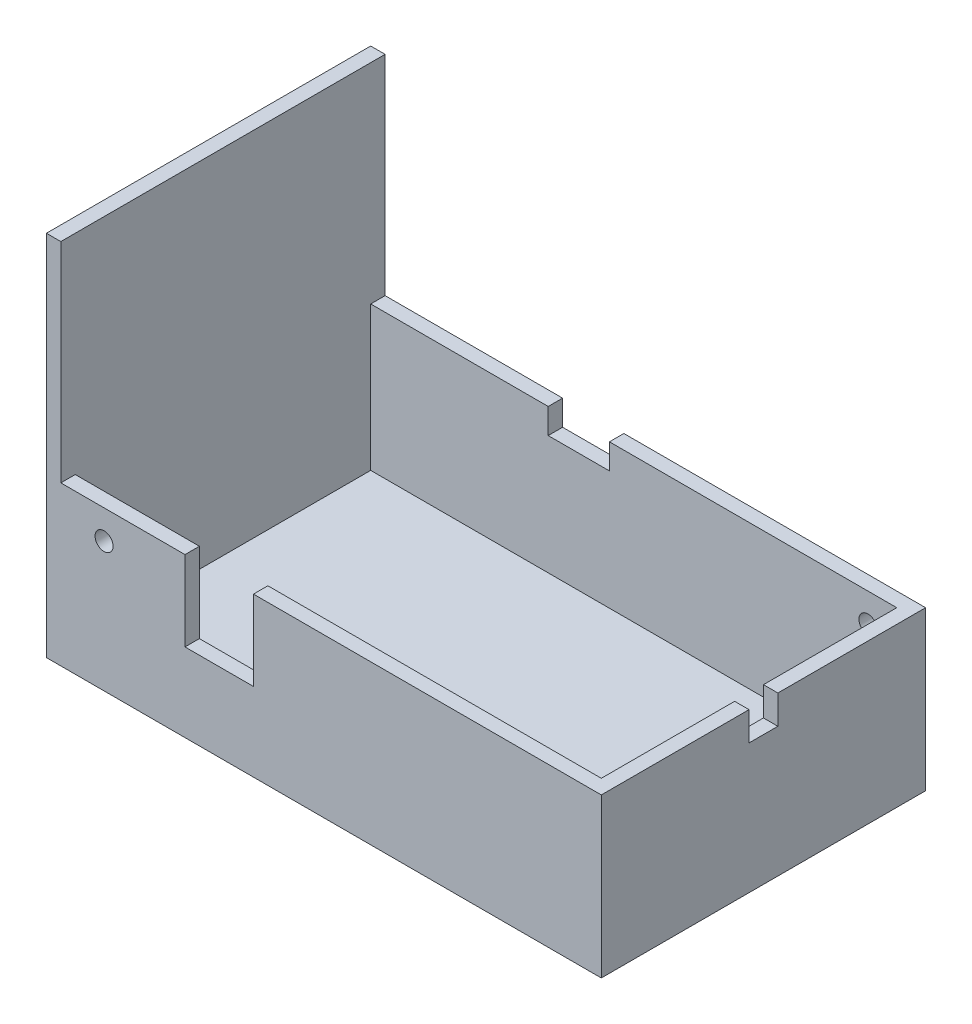
ISO-10303-21;
HEADER;
FILE_DESCRIPTION(('STEP AP214'),'2;1');
FILE_NAME('part.step','',(''),(''),'','','');
FILE_SCHEMA(('AUTOMOTIVE_DESIGN { 1 0 10303 214 1 1 1 1 }'));
ENDSEC;
DATA;
#1=APPLICATION_CONTEXT('core data for automotive mechanical design processes');
#2=APPLICATION_PROTOCOL_DEFINITION('international standard','automotive_design',2000,#1);
#3=PRODUCT_CONTEXT('',#1,'mechanical');
#4=PRODUCT('Part','Part','',(#3));
#5=PRODUCT_RELATED_PRODUCT_CATEGORY('part','',(#4));
#6=PRODUCT_DEFINITION_FORMATION('','',#4);
#7=PRODUCT_DEFINITION_CONTEXT('part definition',#1,'design');
#8=PRODUCT_DEFINITION('design','',#6,#7);
#9=PRODUCT_DEFINITION_SHAPE('','',#8);
#10=(LENGTH_UNIT() NAMED_UNIT(*) SI_UNIT(.MILLI.,.METRE.));
#11=(NAMED_UNIT(*) PLANE_ANGLE_UNIT() SI_UNIT($,.RADIAN.));
#12=(NAMED_UNIT(*) SI_UNIT($,.STERADIAN.) SOLID_ANGLE_UNIT());
#13=UNCERTAINTY_MEASURE_WITH_UNIT(LENGTH_MEASURE(1.E-05),#10,'distance_accuracy_value','');
#14=(GEOMETRIC_REPRESENTATION_CONTEXT(3) GLOBAL_UNCERTAINTY_ASSIGNED_CONTEXT((#13)) GLOBAL_UNIT_ASSIGNED_CONTEXT((#10,
#11,#12)) REPRESENTATION_CONTEXT('',''));
#15=CARTESIAN_POINT('',(0.,0.,0.));
#16=DIRECTION('',(0.,0.,1.));
#17=DIRECTION('',(1.,0.,0.));
#18=AXIS2_PLACEMENT_3D('',#15,#16,#17);
#19=CARTESIAN_POINT('',(0.,22.,0.));
#20=DIRECTION('',(0.,-1.,0.));
#21=DIRECTION('',(0.,0.,-1.));
#22=AXIS2_PLACEMENT_3D('',#19,#20,#21);
#23=PLANE('',#22);
#24=DIRECTION('',(0.,0.,-1.));
#25=VECTOR('',#24,1.);
#26=CARTESIAN_POINT('',(36.5,22.,-20.5));
#27=LINE('',#26,#25);
#28=CARTESIAN_POINT('',(36.5,22.,-2.));
#29=VERTEX_POINT('',#28);
#30=CARTESIAN_POINT('',(36.5,22.,-20.5));
#31=VERTEX_POINT('',#30);
#32=EDGE_CURVE('E301',#29,#31,#27,.T.);
#33=ORIENTED_EDGE('',*,*,#32,.F.);
#34=DIRECTION('',(1.,0.,0.));
#35=VECTOR('',#34,1.);
#36=CARTESIAN_POINT('',(30.8431457505076,22.,-2.));
#37=LINE('',#36,#35);
#38=CARTESIAN_POINT('',(38.5,22.,-2.));
#39=VERTEX_POINT('',#38);
#40=EDGE_CURVE('E190',#29,#39,#37,.T.);
#41=ORIENTED_EDGE('',*,*,#40,.T.);
#42=DIRECTION('',(0.,0.,-1.));
#43=VECTOR('',#42,1.);
#44=CARTESIAN_POINT('',(38.5,22.,-22.5));
#45=LINE('',#44,#43);
#46=CARTESIAN_POINT('',(38.5,22.,-22.5));
#47=VERTEX_POINT('',#46);
#48=EDGE_CURVE('E333',#39,#47,#45,.T.);
#49=ORIENTED_EDGE('',*,*,#48,.T.);
#50=DIRECTION('',(-1.,0.,0.));
#51=VECTOR('',#50,1.);
#52=CARTESIAN_POINT('',(-38.5,22.,-22.5));
#53=LINE('',#52,#51);
#54=CARTESIAN_POINT('',(-3.37,22.,-22.5));
#55=VERTEX_POINT('',#54);
#56=EDGE_CURVE('E338',#47,#55,#53,.T.);
#57=ORIENTED_EDGE('',*,*,#56,.T.);
#58=DIRECTION('',(0.,0.,-1.));
#59=VECTOR('',#58,1.);
#60=CARTESIAN_POINT('',(-3.37,22.,-11.3076118445749));
#61=LINE('',#60,#59);
#62=CARTESIAN_POINT('',(-3.37,22.,-20.5));
#63=VERTEX_POINT('',#62);
#64=EDGE_CURVE('E222',#63,#55,#61,.T.);
#65=ORIENTED_EDGE('',*,*,#64,.F.);
#66=DIRECTION('',(-1.,0.,0.));
#67=VECTOR('',#66,1.);
#68=CARTESIAN_POINT('',(-36.5,22.,-20.5));
#69=LINE('',#68,#67);
#70=EDGE_CURVE('E306',#31,#63,#69,.T.);
#71=ORIENTED_EDGE('',*,*,#70,.F.);
#72=EDGE_LOOP('',(#33,#41,#49,#57,#65,#71));
#73=FACE_BOUND('',#72,.T.);
#74=ADVANCED_FACE('F34',(#73),#23,.F.);
#75=DIRECTION('',(0.,0.,-1.));
#76=VECTOR('',#75,1.);
#77=CARTESIAN_POINT('',(-11.87,22.,-11.3076118445749));
#78=LINE('',#77,#76);
#79=CARTESIAN_POINT('',(-11.87,22.,-20.5));
#80=VERTEX_POINT('',#79);
#81=CARTESIAN_POINT('',(-11.87,22.,-22.5));
#82=VERTEX_POINT('',#81);
#83=EDGE_CURVE('E223',#80,#82,#78,.T.);
#84=ORIENTED_EDGE('',*,*,#83,.T.);
#85=CARTESIAN_POINT('',(-36.5,22.,-22.5));
#86=VERTEX_POINT('',#85);
#87=EDGE_CURVE('E337',#82,#86,#53,.T.);
#88=ORIENTED_EDGE('',*,*,#87,.T.);
#89=DIRECTION('',(0.,0.,-1.));
#90=VECTOR('',#89,1.);
#91=CARTESIAN_POINT('',(-36.5,22.,22.5));
#92=LINE('',#91,#90);
#93=CARTESIAN_POINT('',(-36.5,22.,-20.5));
#94=VERTEX_POINT('',#93);
#95=EDGE_CURVE('E11',#94,#86,#92,.T.);
#96=ORIENTED_EDGE('',*,*,#95,.F.);
#97=EDGE_CURVE('E305',#80,#94,#69,.T.);
#98=ORIENTED_EDGE('',*,*,#97,.F.);
#99=EDGE_LOOP('',(#84,#88,#96,#98));
#100=FACE_BOUND('',#99,.T.);
#101=ADVANCED_FACE('F394',(#100),#23,.F.);
#102=CARTESIAN_POINT('',(-38.5,2.,-22.5));
#103=DIRECTION('',(0.,0.,1.));
#104=DIRECTION('',(1.,0.,0.));
#105=AXIS2_PLACEMENT_3D('',#102,#103,#104);
#106=PLANE('',#105);
#107=CARTESIAN_POINT('',(32.5,18.,-22.5));
#108=DIRECTION('',(0.,0.,-1.));
#109=DIRECTION('',(-1.,0.,0.));
#110=AXIS2_PLACEMENT_3D('',#107,#108,#109);
#111=CIRCLE('',#110,1.25);
#112=CARTESIAN_POINT('',(31.25,18.,-22.5));
#113=VERTEX_POINT('',#112);
#114=EDGE_CURVE('E274',#113,#113,#111,.T.);
#115=ORIENTED_EDGE('',*,*,#114,.F.);
#116=EDGE_LOOP('',(#115));
#117=FACE_BOUND('',#116,.T.);
#118=DIRECTION('',(0.,-1.,0.));
#119=VECTOR('',#118,1.);
#120=CARTESIAN_POINT('',(-11.87,22.,-22.5));
#121=LINE('',#120,#119);
#122=CARTESIAN_POINT('',(-11.87,18.5,-22.5));
#123=VERTEX_POINT('',#122);
#124=EDGE_CURVE('E219',#82,#123,#121,.T.);
#125=ORIENTED_EDGE('',*,*,#124,.T.);
#126=DIRECTION('',(-1.,0.,0.));
#127=VECTOR('',#126,1.);
#128=CARTESIAN_POINT('',(-3.37000000000001,18.5,-22.5));
#129=LINE('',#128,#127);
#130=CARTESIAN_POINT('',(-3.37000000000001,18.5,-22.5));
#131=VERTEX_POINT('',#130);
#132=EDGE_CURVE('E224',#131,#123,#129,.T.);
#133=ORIENTED_EDGE('',*,*,#132,.F.);
#134=DIRECTION('',(0.,-1.,0.));
#135=VECTOR('',#134,1.);
#136=CARTESIAN_POINT('',(-3.37,22.,-22.5));
#137=LINE('',#136,#135);
#138=EDGE_CURVE('E228',#55,#131,#137,.T.);
#139=ORIENTED_EDGE('',*,*,#138,.F.);
#140=ORIENTED_EDGE('',*,*,#56,.F.);
#141=DIRECTION('',(0.,-1.,0.));
#142=VECTOR('',#141,1.);
#143=CARTESIAN_POINT('',(38.5,2.,-22.5));
#144=LINE('',#143,#142);
#145=CARTESIAN_POINT('',(38.5,0.,-22.5));
#146=VERTEX_POINT('',#145);
#147=EDGE_CURVE('E38',#47,#146,#144,.T.);
#148=ORIENTED_EDGE('',*,*,#147,.T.);
#149=DIRECTION('',(-1.,0.,0.));
#150=VECTOR('',#149,1.);
#151=CARTESIAN_POINT('',(-38.5,0.,-22.5));
#152=LINE('',#151,#150);
#153=CARTESIAN_POINT('',(-38.5,0.,-22.5));
#154=VERTEX_POINT('',#153);
#155=EDGE_CURVE('E344',#146,#154,#152,.T.);
#156=ORIENTED_EDGE('',*,*,#155,.T.);
#157=DIRECTION('',(0.,-1.,0.));
#158=VECTOR('',#157,1.);
#159=CARTESIAN_POINT('',(-38.5,2.,-22.5));
#160=LINE('',#159,#158);
#161=CARTESIAN_POINT('',(-38.5,51.,-22.5));
#162=VERTEX_POINT('',#161);
#163=EDGE_CURVE('E355',#162,#154,#160,.T.);
#164=ORIENTED_EDGE('',*,*,#163,.F.);
#165=DIRECTION('',(-1.,0.,0.));
#166=VECTOR('',#165,1.);
#167=CARTESIAN_POINT('',(-38.5,51.,-22.5));
#168=LINE('',#167,#166);
#169=CARTESIAN_POINT('',(-36.5,51.,-22.5));
#170=VERTEX_POINT('',#169);
#171=EDGE_CURVE('E287',#170,#162,#168,.T.);
#172=ORIENTED_EDGE('',*,*,#171,.F.);
#173=DIRECTION('',(0.,-1.,0.));
#174=VECTOR('',#173,1.);
#175=CARTESIAN_POINT('',(-36.5,51.,-22.5));
#176=LINE('',#175,#174);
#177=EDGE_CURVE('E289',#170,#86,#176,.T.);
#178=ORIENTED_EDGE('',*,*,#177,.T.);
#179=ORIENTED_EDGE('',*,*,#87,.F.);
#180=EDGE_LOOP('',(#125,#133,#139,#140,#148,#156,#164,#172,#178,#179));
#181=FACE_BOUND('',#180,.T.);
#182=ADVANCED_FACE('F364',(#117,#181),#106,.F.);
#183=CARTESIAN_POINT('',(-36.5,22.,-20.5));
#184=DIRECTION('',(0.,0.,1.));
#185=DIRECTION('',(1.,0.,0.));
#186=AXIS2_PLACEMENT_3D('',#183,#184,#185);
#187=PLANE('',#186);
#188=CARTESIAN_POINT('',(32.5,18.,-20.5));
#189=DIRECTION('',(0.,0.,1.));
#190=DIRECTION('',(1.,0.,0.));
#191=AXIS2_PLACEMENT_3D('',#188,#189,#190);
#192=CIRCLE('',#191,1.25);
#193=CARTESIAN_POINT('',(33.75,18.,-20.5));
#194=VERTEX_POINT('',#193);
#195=EDGE_CURVE('E277',#194,#194,#192,.F.);
#196=ORIENTED_EDGE('',*,*,#195,.T.);
#197=EDGE_LOOP('',(#196));
#198=FACE_BOUND('',#197,.T.);
#199=DIRECTION('',(-1.,0.,0.));
#200=VECTOR('',#199,1.);
#201=CARTESIAN_POINT('',(-3.37000000000001,18.5,-20.5));
#202=LINE('',#201,#200);
#203=CARTESIAN_POINT('',(-3.37000000000001,18.5,-20.5));
#204=VERTEX_POINT('',#203);
#205=CARTESIAN_POINT('',(-11.87,18.5,-20.5));
#206=VERTEX_POINT('',#205);
#207=EDGE_CURVE('E227',#204,#206,#202,.T.);
#208=ORIENTED_EDGE('',*,*,#207,.T.);
#209=DIRECTION('',(0.,-1.,0.));
#210=VECTOR('',#209,1.);
#211=CARTESIAN_POINT('',(-11.87,22.,-20.5));
#212=LINE('',#211,#210);
#213=EDGE_CURVE('E218',#80,#206,#212,.T.);
#214=ORIENTED_EDGE('',*,*,#213,.F.);
#215=ORIENTED_EDGE('',*,*,#97,.T.);
#216=DIRECTION('',(0.,-1.,0.));
#217=VECTOR('',#216,1.);
#218=CARTESIAN_POINT('',(-36.5,22.,-20.5));
#219=LINE('',#218,#217);
#220=CARTESIAN_POINT('',(-36.5,2.,-20.5));
#221=VERTEX_POINT('',#220);
#222=EDGE_CURVE('E309',#94,#221,#219,.T.);
#223=ORIENTED_EDGE('',*,*,#222,.T.);
#224=DIRECTION('',(-1.,0.,0.));
#225=VECTOR('',#224,1.);
#226=CARTESIAN_POINT('',(-36.5,2.,-20.5));
#227=LINE('',#226,#225);
#228=CARTESIAN_POINT('',(36.5,2.,-20.5));
#229=VERTEX_POINT('',#228);
#230=EDGE_CURVE('E318',#229,#221,#227,.T.);
#231=ORIENTED_EDGE('',*,*,#230,.F.);
#232=DIRECTION('',(0.,-1.,0.));
#233=VECTOR('',#232,1.);
#234=CARTESIAN_POINT('',(36.5,22.,-20.5));
#235=LINE('',#234,#233);
#236=EDGE_CURVE('E322',#31,#229,#235,.T.);
#237=ORIENTED_EDGE('',*,*,#236,.F.);
#238=ORIENTED_EDGE('',*,*,#70,.T.);
#239=DIRECTION('',(0.,-1.,0.));
#240=VECTOR('',#239,1.);
#241=CARTESIAN_POINT('',(-3.37,22.,-20.5));
#242=LINE('',#241,#240);
#243=EDGE_CURVE('E233',#63,#204,#242,.T.);
#244=ORIENTED_EDGE('',*,*,#243,.T.);
#245=EDGE_LOOP('',(#208,#214,#215,#223,#231,#237,#238,#244));
#246=FACE_BOUND('',#245,.T.);
#247=ADVANCED_FACE('F400',(#198,#246),#187,.T.);
#248=CARTESIAN_POINT('',(38.5,22.,22.5));
#249=VERTEX_POINT('',#248);
#250=CARTESIAN_POINT('',(38.5,22.,2.));
#251=VERTEX_POINT('',#250);
#252=EDGE_CURVE('E334',#249,#251,#45,.T.);
#253=ORIENTED_EDGE('',*,*,#252,.T.);
#254=DIRECTION('',(1.,0.,0.));
#255=VECTOR('',#254,1.);
#256=CARTESIAN_POINT('',(30.8431457505076,22.,2.));
#257=LINE('',#256,#255);
#258=CARTESIAN_POINT('',(36.5,22.,2.));
#259=VERTEX_POINT('',#258);
#260=EDGE_CURVE('E213',#259,#251,#257,.T.);
#261=ORIENTED_EDGE('',*,*,#260,.F.);
#262=CARTESIAN_POINT('',(36.5,22.,20.5));
#263=VERTEX_POINT('',#262);
#264=EDGE_CURVE('E303',#263,#259,#27,.T.);
#265=ORIENTED_EDGE('',*,*,#264,.F.);
#266=DIRECTION('',(1.,0.,0.));
#267=VECTOR('',#266,1.);
#268=CARTESIAN_POINT('',(36.5,22.,20.5));
#269=LINE('',#268,#267);
#270=CARTESIAN_POINT('',(-9.77000000000001,22.,20.5));
#271=VERTEX_POINT('',#270);
#272=EDGE_CURVE('E302',#271,#263,#269,.T.);
#273=ORIENTED_EDGE('',*,*,#272,.F.);
#274=DIRECTION('',(0.,0.,1.));
#275=VECTOR('',#274,1.);
#276=CARTESIAN_POINT('',(-9.77000000000001,22.,5.8897296397363));
#277=LINE('',#276,#275);
#278=CARTESIAN_POINT('',(-9.77000000000001,22.,22.5));
#279=VERTEX_POINT('',#278);
#280=EDGE_CURVE('E262',#271,#279,#277,.T.);
#281=ORIENTED_EDGE('',*,*,#280,.T.);
#282=DIRECTION('',(1.,0.,0.));
#283=VECTOR('',#282,1.);
#284=CARTESIAN_POINT('',(38.5,22.,22.5));
#285=LINE('',#284,#283);
#286=EDGE_CURVE('E329',#279,#249,#285,.T.);
#287=ORIENTED_EDGE('',*,*,#286,.T.);
#288=EDGE_LOOP('',(#253,#261,#265,#273,#281,#287));
#289=FACE_BOUND('',#288,.T.);
#290=ADVANCED_FACE('F412',(#289),#23,.F.);
#291=CARTESIAN_POINT('',(-36.5,22.,22.5));
#292=VERTEX_POINT('',#291);
#293=CARTESIAN_POINT('',(-19.27,22.,22.5));
#294=VERTEX_POINT('',#293);
#295=EDGE_CURVE('E330',#292,#294,#285,.T.);
#296=ORIENTED_EDGE('',*,*,#295,.T.);
#297=DIRECTION('',(0.,0.,1.));
#298=VECTOR('',#297,1.);
#299=CARTESIAN_POINT('',(-19.27,22.,5.8897296397363));
#300=LINE('',#299,#298);
#301=CARTESIAN_POINT('',(-19.27,22.,20.5));
#302=VERTEX_POINT('',#301);
#303=EDGE_CURVE('E258',#302,#294,#300,.T.);
#304=ORIENTED_EDGE('',*,*,#303,.F.);
#305=CARTESIAN_POINT('',(-36.5,22.,20.5));
#306=VERTEX_POINT('',#305);
#307=EDGE_CURVE('E298',#306,#302,#269,.T.);
#308=ORIENTED_EDGE('',*,*,#307,.F.);
#309=EDGE_CURVE('E44',#292,#306,#92,.T.);
#310=ORIENTED_EDGE('',*,*,#309,.F.);
#311=EDGE_LOOP('',(#296,#304,#308,#310));
#312=FACE_BOUND('',#311,.T.);
#313=ADVANCED_FACE('F432',(#312),#23,.F.);
#314=CARTESIAN_POINT('',(38.5,2.,22.5));
#315=DIRECTION('',(-1.,0.,0.));
#316=DIRECTION('',(0.,0.,1.));
#317=AXIS2_PLACEMENT_3D('',#314,#315,#316);
#318=PLANE('',#317);
#319=ORIENTED_EDGE('',*,*,#48,.F.);
#320=DIRECTION('',(0.,1.,0.));
#321=VECTOR('',#320,1.);
#322=CARTESIAN_POINT('',(38.5,22.,-2.));
#323=LINE('',#322,#321);
#324=CARTESIAN_POINT('',(38.5,18.,-2.));
#325=VERTEX_POINT('',#324);
#326=EDGE_CURVE('E206',#325,#39,#323,.T.);
#327=ORIENTED_EDGE('',*,*,#326,.F.);
#328=DIRECTION('',(0.,0.,-1.));
#329=VECTOR('',#328,1.);
#330=CARTESIAN_POINT('',(38.5,18.,2.));
#331=LINE('',#330,#329);
#332=CARTESIAN_POINT('',(38.5,18.,2.));
#333=VERTEX_POINT('',#332);
#334=EDGE_CURVE('E200',#333,#325,#331,.T.);
#335=ORIENTED_EDGE('',*,*,#334,.F.);
#336=DIRECTION('',(0.,-1.,0.));
#337=VECTOR('',#336,1.);
#338=CARTESIAN_POINT('',(38.5,22.,2.));
#339=LINE('',#338,#337);
#340=EDGE_CURVE('E211',#251,#333,#339,.T.);
#341=ORIENTED_EDGE('',*,*,#340,.F.);
#342=ORIENTED_EDGE('',*,*,#252,.F.);
#343=DIRECTION('',(0.,-1.,0.));
#344=VECTOR('',#343,1.);
#345=CARTESIAN_POINT('',(38.5,2.,22.5));
#346=LINE('',#345,#344);
#347=CARTESIAN_POINT('',(38.5,0.,22.5));
#348=VERTEX_POINT('',#347);
#349=EDGE_CURVE('E350',#249,#348,#346,.T.);
#350=ORIENTED_EDGE('',*,*,#349,.T.);
#351=DIRECTION('',(0.,0.,-1.));
#352=VECTOR('',#351,1.);
#353=CARTESIAN_POINT('',(38.5,0.,22.5));
#354=LINE('',#353,#352);
#355=EDGE_CURVE('E341',#348,#146,#354,.T.);
#356=ORIENTED_EDGE('',*,*,#355,.T.);
#357=ORIENTED_EDGE('',*,*,#147,.F.);
#358=EDGE_LOOP('',(#319,#327,#335,#341,#342,#350,#356,#357));
#359=FACE_BOUND('',#358,.T.);
#360=ADVANCED_FACE('F36',(#359),#318,.F.);
#361=CARTESIAN_POINT('',(-38.5,2.,22.5));
#362=DIRECTION('',(1.,0.,0.));
#363=DIRECTION('',(0.,0.,-1.));
#364=AXIS2_PLACEMENT_3D('',#361,#362,#363);
#365=PLANE('',#364);
#366=DIRECTION('',(0.,0.,1.));
#367=VECTOR('',#366,1.);
#368=CARTESIAN_POINT('',(-38.5,0.,22.5));
#369=LINE('',#368,#367);
#370=CARTESIAN_POINT('',(-38.5,0.,22.5));
#371=VERTEX_POINT('',#370);
#372=EDGE_CURVE('E346',#154,#371,#369,.T.);
#373=ORIENTED_EDGE('',*,*,#372,.T.);
#374=DIRECTION('',(0.,-1.,0.));
#375=VECTOR('',#374,1.);
#376=CARTESIAN_POINT('',(-38.5,2.,22.5));
#377=LINE('',#376,#375);
#378=CARTESIAN_POINT('',(-38.5,51.,22.5));
#379=VERTEX_POINT('',#378);
#380=EDGE_CURVE('E353',#379,#371,#377,.T.);
#381=ORIENTED_EDGE('',*,*,#380,.F.);
#382=DIRECTION('',(0.,0.,1.));
#383=VECTOR('',#382,1.);
#384=CARTESIAN_POINT('',(-38.5,51.,22.5));
#385=LINE('',#384,#383);
#386=EDGE_CURVE('E280',#162,#379,#385,.T.);
#387=ORIENTED_EDGE('',*,*,#386,.F.);
#388=ORIENTED_EDGE('',*,*,#163,.T.);
#389=EDGE_LOOP('',(#373,#381,#387,#388));
#390=FACE_BOUND('',#389,.T.);
#391=ADVANCED_FACE('F374',(#390),#365,.F.);
#392=CARTESIAN_POINT('',(-38.5,2.,22.5));
#393=DIRECTION('',(0.,0.,-1.));
#394=DIRECTION('',(-1.,0.,0.));
#395=AXIS2_PLACEMENT_3D('',#392,#393,#394);
#396=PLANE('',#395);
#397=CARTESIAN_POINT('',(-30.5,18.,22.5));
#398=DIRECTION('',(0.,0.,1.));
#399=DIRECTION('',(1.,0.,0.));
#400=AXIS2_PLACEMENT_3D('',#397,#398,#399);
#401=CIRCLE('',#400,1.25);
#402=CARTESIAN_POINT('',(-29.25,18.,22.5));
#403=VERTEX_POINT('',#402);
#404=EDGE_CURVE('E268',#403,#403,#401,.T.);
#405=ORIENTED_EDGE('',*,*,#404,.F.);
#406=EDGE_LOOP('',(#405));
#407=FACE_BOUND('',#406,.T.);
#408=ORIENTED_EDGE('',*,*,#286,.F.);
#409=DIRECTION('',(0.,1.,0.));
#410=VECTOR('',#409,1.);
#411=CARTESIAN_POINT('',(-9.77000000000001,22.,22.5));
#412=LINE('',#411,#410);
#413=CARTESIAN_POINT('',(-9.77,10.9,22.5));
#414=VERTEX_POINT('',#413);
#415=EDGE_CURVE('E243',#414,#279,#412,.T.);
#416=ORIENTED_EDGE('',*,*,#415,.F.);
#417=DIRECTION('',(1.,0.,0.));
#418=VECTOR('',#417,1.);
#419=CARTESIAN_POINT('',(-19.27,10.9,22.5));
#420=LINE('',#419,#418);
#421=CARTESIAN_POINT('',(-19.27,10.9,22.5));
#422=VERTEX_POINT('',#421);
#423=EDGE_CURVE('E246',#422,#414,#420,.T.);
#424=ORIENTED_EDGE('',*,*,#423,.F.);
#425=DIRECTION('',(0.,-1.,0.));
#426=VECTOR('',#425,1.);
#427=CARTESIAN_POINT('',(-19.27,22.,22.5));
#428=LINE('',#427,#426);
#429=EDGE_CURVE('E242',#294,#422,#428,.T.);
#430=ORIENTED_EDGE('',*,*,#429,.F.);
#431=ORIENTED_EDGE('',*,*,#295,.F.);
#432=DIRECTION('',(0.,-1.,0.));
#433=VECTOR('',#432,1.);
#434=CARTESIAN_POINT('',(-36.5,51.,22.5));
#435=LINE('',#434,#433);
#436=CARTESIAN_POINT('',(-36.5,51.,22.5));
#437=VERTEX_POINT('',#436);
#438=EDGE_CURVE('E294',#437,#292,#435,.T.);
#439=ORIENTED_EDGE('',*,*,#438,.F.);
#440=DIRECTION('',(1.,0.,0.));
#441=VECTOR('',#440,1.);
#442=CARTESIAN_POINT('',(-38.5,51.,22.5));
#443=LINE('',#442,#441);
#444=EDGE_CURVE('E283',#379,#437,#443,.T.);
#445=ORIENTED_EDGE('',*,*,#444,.F.);
#446=ORIENTED_EDGE('',*,*,#380,.T.);
#447=DIRECTION('',(1.,0.,0.));
#448=VECTOR('',#447,1.);
#449=CARTESIAN_POINT('',(-38.5,0.,22.5));
#450=LINE('',#449,#448);
#451=EDGE_CURVE('E348',#371,#348,#450,.T.);
#452=ORIENTED_EDGE('',*,*,#451,.T.);
#453=ORIENTED_EDGE('',*,*,#349,.F.);
#454=EDGE_LOOP('',(#408,#416,#424,#430,#431,#439,#445,#446,#452,#453));
#455=FACE_BOUND('',#454,.T.);
#456=ADVANCED_FACE('F378',(#407,#455),#396,.F.);
#457=CARTESIAN_POINT('',(0.,0.,0.));
#458=DIRECTION('',(0.,-1.,0.));
#459=DIRECTION('',(0.,0.,-1.));
#460=AXIS2_PLACEMENT_3D('',#457,#458,#459);
#461=PLANE('',#460);
#462=ORIENTED_EDGE('',*,*,#355,.F.);
#463=ORIENTED_EDGE('',*,*,#451,.F.);
#464=ORIENTED_EDGE('',*,*,#372,.F.);
#465=ORIENTED_EDGE('',*,*,#155,.F.);
#466=EDGE_LOOP('',(#462,#463,#464,#465));
#467=FACE_BOUND('',#466,.T.);
#468=ADVANCED_FACE('F373',(#467),#461,.T.);
#469=CARTESIAN_POINT('',(-36.5,22.,20.5));
#470=DIRECTION('',(1.,0.,0.));
#471=DIRECTION('',(0.,0.,-1.));
#472=AXIS2_PLACEMENT_3D('',#469,#470,#471);
#473=PLANE('',#472);
#474=DIRECTION('',(0.,0.,1.));
#475=VECTOR('',#474,1.);
#476=CARTESIAN_POINT('',(-36.5,2.,20.5));
#477=LINE('',#476,#475);
#478=CARTESIAN_POINT('',(-36.5,2.,20.5));
#479=VERTEX_POINT('',#478);
#480=EDGE_CURVE('E297',#221,#479,#477,.T.);
#481=ORIENTED_EDGE('',*,*,#480,.F.);
#482=ORIENTED_EDGE('',*,*,#222,.F.);
#483=ORIENTED_EDGE('',*,*,#95,.T.);
#484=ORIENTED_EDGE('',*,*,#177,.F.);
#485=DIRECTION('',(0.,0.,-1.));
#486=VECTOR('',#485,1.);
#487=CARTESIAN_POINT('',(-36.5,51.,22.5));
#488=LINE('',#487,#486);
#489=EDGE_CURVE('E285',#437,#170,#488,.T.);
#490=ORIENTED_EDGE('',*,*,#489,.F.);
#491=ORIENTED_EDGE('',*,*,#438,.T.);
#492=ORIENTED_EDGE('',*,*,#309,.T.);
#493=DIRECTION('',(0.,-1.,0.));
#494=VECTOR('',#493,1.);
#495=CARTESIAN_POINT('',(-36.5,22.,20.5));
#496=LINE('',#495,#494);
#497=EDGE_CURVE('E326',#306,#479,#496,.T.);
#498=ORIENTED_EDGE('',*,*,#497,.T.);
#499=EDGE_LOOP('',(#481,#482,#483,#484,#490,#491,#492,#498));
#500=FACE_BOUND('',#499,.T.);
#501=ADVANCED_FACE('F389',(#500),#473,.T.);
#502=CARTESIAN_POINT('',(36.5,22.,20.5));
#503=DIRECTION('',(0.,0.,-1.));
#504=DIRECTION('',(-1.,0.,0.));
#505=AXIS2_PLACEMENT_3D('',#502,#503,#504);
#506=PLANE('',#505);
#507=DIRECTION('',(0.,1.,0.));
#508=VECTOR('',#507,1.);
#509=CARTESIAN_POINT('',(-9.77000000000001,22.,20.5));
#510=LINE('',#509,#508);
#511=CARTESIAN_POINT('',(-9.77,10.9,20.5));
#512=VERTEX_POINT('',#511);
#513=EDGE_CURVE('E259',#512,#271,#510,.T.);
#514=ORIENTED_EDGE('',*,*,#513,.T.);
#515=ORIENTED_EDGE('',*,*,#272,.T.);
#516=DIRECTION('',(0.,-1.,0.));
#517=VECTOR('',#516,1.);
#518=CARTESIAN_POINT('',(36.5,22.,20.5));
#519=LINE('',#518,#517);
#520=CARTESIAN_POINT('',(36.5,2.,20.5));
#521=VERTEX_POINT('',#520);
#522=EDGE_CURVE('E324',#263,#521,#519,.T.);
#523=ORIENTED_EDGE('',*,*,#522,.T.);
#524=DIRECTION('',(1.,0.,0.));
#525=VECTOR('',#524,1.);
#526=CARTESIAN_POINT('',(36.5,2.,20.5));
#527=LINE('',#526,#525);
#528=EDGE_CURVE('E312',#479,#521,#527,.T.);
#529=ORIENTED_EDGE('',*,*,#528,.F.);
#530=ORIENTED_EDGE('',*,*,#497,.F.);
#531=ORIENTED_EDGE('',*,*,#307,.T.);
#532=DIRECTION('',(0.,-1.,0.));
#533=VECTOR('',#532,1.);
#534=CARTESIAN_POINT('',(-19.27,22.,20.5));
#535=LINE('',#534,#533);
#536=CARTESIAN_POINT('',(-19.27,10.9,20.5));
#537=VERTEX_POINT('',#536);
#538=EDGE_CURVE('E254',#302,#537,#535,.T.);
#539=ORIENTED_EDGE('',*,*,#538,.T.);
#540=DIRECTION('',(1.,0.,0.));
#541=VECTOR('',#540,1.);
#542=CARTESIAN_POINT('',(-19.27,10.9,20.5));
#543=LINE('',#542,#541);
#544=EDGE_CURVE('E245',#537,#512,#543,.T.);
#545=ORIENTED_EDGE('',*,*,#544,.T.);
#546=EDGE_LOOP('',(#514,#515,#523,#529,#530,#531,#539,#545));
#547=FACE_BOUND('',#546,.T.);
#548=CARTESIAN_POINT('',(-30.5,18.,20.5));
#549=DIRECTION('',(0.,0.,-1.));
#550=DIRECTION('',(-1.,0.,0.));
#551=AXIS2_PLACEMENT_3D('',#548,#549,#550);
#552=CIRCLE('',#551,1.25);
#553=CARTESIAN_POINT('',(-31.75,18.,20.5));
#554=VERTEX_POINT('',#553);
#555=EDGE_CURVE('E271',#554,#554,#552,.F.);
#556=ORIENTED_EDGE('',*,*,#555,.T.);
#557=EDGE_LOOP('',(#556));
#558=FACE_BOUND('',#557,.T.);
#559=ADVANCED_FACE('F417',(#547,#558),#506,.T.);
#560=CARTESIAN_POINT('',(36.5,22.,-20.5));
#561=DIRECTION('',(-1.,0.,0.));
#562=DIRECTION('',(0.,0.,1.));
#563=AXIS2_PLACEMENT_3D('',#560,#561,#562);
#564=PLANE('',#563);
#565=DIRECTION('',(0.,1.,0.));
#566=VECTOR('',#565,1.);
#567=CARTESIAN_POINT('',(36.5,22.,-2.));
#568=LINE('',#567,#566);
#569=CARTESIAN_POINT('',(36.5,18.,-2.));
#570=VERTEX_POINT('',#569);
#571=EDGE_CURVE('E184',#570,#29,#568,.T.);
#572=ORIENTED_EDGE('',*,*,#571,.T.);
#573=ORIENTED_EDGE('',*,*,#32,.T.);
#574=ORIENTED_EDGE('',*,*,#236,.T.);
#575=DIRECTION('',(0.,0.,-1.));
#576=VECTOR('',#575,1.);
#577=CARTESIAN_POINT('',(36.5,2.,-20.5));
#578=LINE('',#577,#576);
#579=EDGE_CURVE('E315',#521,#229,#578,.T.);
#580=ORIENTED_EDGE('',*,*,#579,.F.);
#581=ORIENTED_EDGE('',*,*,#522,.F.);
#582=ORIENTED_EDGE('',*,*,#264,.T.);
#583=DIRECTION('',(0.,-1.,0.));
#584=VECTOR('',#583,1.);
#585=CARTESIAN_POINT('',(36.5,22.,2.));
#586=LINE('',#585,#584);
#587=CARTESIAN_POINT('',(36.5,18.,2.));
#588=VERTEX_POINT('',#587);
#589=EDGE_CURVE('E205',#259,#588,#586,.T.);
#590=ORIENTED_EDGE('',*,*,#589,.T.);
#591=DIRECTION('',(0.,0.,-1.));
#592=VECTOR('',#591,1.);
#593=CARTESIAN_POINT('',(36.5,18.,2.));
#594=LINE('',#593,#592);
#595=EDGE_CURVE('E197',#588,#570,#594,.T.);
#596=ORIENTED_EDGE('',*,*,#595,.T.);
#597=EDGE_LOOP('',(#572,#573,#574,#580,#581,#582,#590,#596));
#598=FACE_BOUND('',#597,.T.);
#599=ADVANCED_FACE('F203',(#598),#564,.T.);
#600=CARTESIAN_POINT('',(0.,2.,0.));
#601=DIRECTION('',(0.,-1.,0.));
#602=DIRECTION('',(0.,0.,-1.));
#603=AXIS2_PLACEMENT_3D('',#600,#601,#602);
#604=PLANE('',#603);
#605=ORIENTED_EDGE('',*,*,#230,.T.);
#606=ORIENTED_EDGE('',*,*,#480,.T.);
#607=ORIENTED_EDGE('',*,*,#528,.T.);
#608=ORIENTED_EDGE('',*,*,#579,.T.);
#609=EDGE_LOOP('',(#605,#606,#607,#608));
#610=FACE_BOUND('',#609,.T.);
#611=ADVANCED_FACE('F435',(#610),#604,.F.);
#612=CARTESIAN_POINT('',(0.,51.,0.));
#613=DIRECTION('',(0.,-1.,0.));
#614=DIRECTION('',(0.,0.,-1.));
#615=AXIS2_PLACEMENT_3D('',#612,#613,#614);
#616=PLANE('',#615);
#617=ORIENTED_EDGE('',*,*,#386,.T.);
#618=ORIENTED_EDGE('',*,*,#444,.T.);
#619=ORIENTED_EDGE('',*,*,#489,.T.);
#620=ORIENTED_EDGE('',*,*,#171,.T.);
#621=EDGE_LOOP('',(#617,#618,#619,#620));
#622=FACE_BOUND('',#621,.T.);
#623=ADVANCED_FACE('F383',(#622),#616,.F.);
#624=CARTESIAN_POINT('',(32.5,18.,-16.9644660940672));
#625=DIRECTION('',(0.,0.,-1.));
#626=DIRECTION('',(-1.,0.,0.));
#627=AXIS2_PLACEMENT_3D('',#624,#625,#626);
#628=CYLINDRICAL_SURFACE('',#627,1.25);
#629=ORIENTED_EDGE('',*,*,#114,.T.);
#630=EDGE_LOOP('',(#629));
#631=FACE_BOUND('',#630,.T.);
#632=ORIENTED_EDGE('',*,*,#195,.F.);
#633=EDGE_LOOP('',(#632));
#634=FACE_BOUND('',#633,.T.);
#635=ADVANCED_FACE('F444',(#631,#634),#628,.F.);
#636=CARTESIAN_POINT('',(-30.5,18.,16.9644660940673));
#637=DIRECTION('',(0.,0.,1.));
#638=DIRECTION('',(1.,0.,0.));
#639=AXIS2_PLACEMENT_3D('',#636,#637,#638);
#640=CYLINDRICAL_SURFACE('',#639,1.25);
#641=ORIENTED_EDGE('',*,*,#404,.T.);
#642=EDGE_LOOP('',(#641));
#643=FACE_BOUND('',#642,.T.);
#644=ORIENTED_EDGE('',*,*,#555,.F.);
#645=EDGE_LOOP('',(#644));
#646=FACE_BOUND('',#645,.T.);
#647=ADVANCED_FACE('F512',(#643,#646),#640,.F.);
#648=CARTESIAN_POINT('',(-19.27,10.9,5.8897296397363));
#649=DIRECTION('',(0.,-1.,0.));
#650=DIRECTION('',(0.,0.,-1.));
#651=AXIS2_PLACEMENT_3D('',#648,#649,#650);
#652=PLANE('',#651);
#653=DIRECTION('',(0.,0.,1.));
#654=VECTOR('',#653,1.);
#655=CARTESIAN_POINT('',(-19.27,10.9,5.8897296397363));
#656=LINE('',#655,#654);
#657=EDGE_CURVE('E257',#537,#422,#656,.T.);
#658=ORIENTED_EDGE('',*,*,#657,.T.);
#659=ORIENTED_EDGE('',*,*,#423,.T.);
#660=DIRECTION('',(0.,0.,1.));
#661=VECTOR('',#660,1.);
#662=CARTESIAN_POINT('',(-9.77,10.9,5.8897296397363));
#663=LINE('',#662,#661);
#664=EDGE_CURVE('E253',#512,#414,#663,.T.);
#665=ORIENTED_EDGE('',*,*,#664,.F.);
#666=ORIENTED_EDGE('',*,*,#544,.F.);
#667=EDGE_LOOP('',(#658,#659,#665,#666));
#668=FACE_BOUND('',#667,.T.);
#669=ADVANCED_FACE('F427',(#668),#652,.F.);
#670=CARTESIAN_POINT('',(-9.77000000000001,22.,5.8897296397363));
#671=DIRECTION('',(1.,0.,0.));
#672=DIRECTION('',(0.,1.,0.));
#673=AXIS2_PLACEMENT_3D('',#670,#671,#672);
#674=PLANE('',#673);
#675=ORIENTED_EDGE('',*,*,#664,.T.);
#676=ORIENTED_EDGE('',*,*,#415,.T.);
#677=ORIENTED_EDGE('',*,*,#280,.F.);
#678=ORIENTED_EDGE('',*,*,#513,.F.);
#679=EDGE_LOOP('',(#675,#676,#677,#678));
#680=FACE_BOUND('',#679,.T.);
#681=ADVANCED_FACE('F423',(#680),#674,.F.);
#682=CARTESIAN_POINT('',(-19.27,22.,5.8897296397363));
#683=DIRECTION('',(-1.,0.,0.));
#684=DIRECTION('',(0.,0.,1.));
#685=AXIS2_PLACEMENT_3D('',#682,#683,#684);
#686=PLANE('',#685);
#687=ORIENTED_EDGE('',*,*,#303,.T.);
#688=ORIENTED_EDGE('',*,*,#429,.T.);
#689=ORIENTED_EDGE('',*,*,#657,.F.);
#690=ORIENTED_EDGE('',*,*,#538,.F.);
#691=EDGE_LOOP('',(#687,#688,#689,#690));
#692=FACE_BOUND('',#691,.T.);
#693=ADVANCED_FACE('F429',(#692),#686,.F.);
#694=CARTESIAN_POINT('',(-3.37000000000001,18.5,-11.3076118445749));
#695=DIRECTION('',(0.,-1.,0.));
#696=DIRECTION('',(0.,0.,-1.));
#697=AXIS2_PLACEMENT_3D('',#694,#695,#696);
#698=PLANE('',#697);
#699=DIRECTION('',(0.,0.,-1.));
#700=VECTOR('',#699,1.);
#701=CARTESIAN_POINT('',(-3.37000000000001,18.5,-11.3076118445749));
#702=LINE('',#701,#700);
#703=EDGE_CURVE('E59',#204,#131,#702,.T.);
#704=ORIENTED_EDGE('',*,*,#703,.T.);
#705=ORIENTED_EDGE('',*,*,#132,.T.);
#706=DIRECTION('',(0.,0.,-1.));
#707=VECTOR('',#706,1.);
#708=CARTESIAN_POINT('',(-11.87,18.5,-11.3076118445749));
#709=LINE('',#708,#707);
#710=EDGE_CURVE('E232',#206,#123,#709,.T.);
#711=ORIENTED_EDGE('',*,*,#710,.F.);
#712=ORIENTED_EDGE('',*,*,#207,.F.);
#713=EDGE_LOOP('',(#704,#705,#711,#712));
#714=FACE_BOUND('',#713,.T.);
#715=ADVANCED_FACE('F402',(#714),#698,.F.);
#716=CARTESIAN_POINT('',(-11.87,22.,-11.3076118445749));
#717=DIRECTION('',(1.,0.,0.));
#718=DIRECTION('',(0.,0.,-1.));
#719=AXIS2_PLACEMENT_3D('',#716,#717,#718);
#720=PLANE('',#719);
#721=ORIENTED_EDGE('',*,*,#213,.T.);
#722=ORIENTED_EDGE('',*,*,#710,.T.);
#723=ORIENTED_EDGE('',*,*,#124,.F.);
#724=ORIENTED_EDGE('',*,*,#83,.F.);
#725=EDGE_LOOP('',(#721,#722,#723,#724));
#726=FACE_BOUND('',#725,.T.);
#727=ADVANCED_FACE('F397',(#726),#720,.T.);
#728=CARTESIAN_POINT('',(-3.37,22.,-11.3076118445749));
#729=DIRECTION('',(1.,0.,0.));
#730=DIRECTION('',(0.,1.,0.));
#731=AXIS2_PLACEMENT_3D('',#728,#729,#730);
#732=PLANE('',#731);
#733=ORIENTED_EDGE('',*,*,#64,.T.);
#734=ORIENTED_EDGE('',*,*,#138,.T.);
#735=ORIENTED_EDGE('',*,*,#703,.F.);
#736=ORIENTED_EDGE('',*,*,#243,.F.);
#737=EDGE_LOOP('',(#733,#734,#735,#736));
#738=FACE_BOUND('',#737,.T.);
#739=ADVANCED_FACE('F565',(#738),#732,.F.);
#740=CARTESIAN_POINT('',(30.8431457505076,18.,2.));
#741=DIRECTION('',(0.,-1.,0.));
#742=DIRECTION('',(0.,0.,-1.));
#743=AXIS2_PLACEMENT_3D('',#740,#741,#742);
#744=PLANE('',#743);
#745=DIRECTION('',(1.,0.,0.));
#746=VECTOR('',#745,1.);
#747=CARTESIAN_POINT('',(30.8431457505076,18.,2.));
#748=LINE('',#747,#746);
#749=EDGE_CURVE('E51',#588,#333,#748,.T.);
#750=ORIENTED_EDGE('',*,*,#749,.T.);
#751=ORIENTED_EDGE('',*,*,#334,.T.);
#752=DIRECTION('',(1.,0.,0.));
#753=VECTOR('',#752,1.);
#754=CARTESIAN_POINT('',(30.8431457505076,18.,-2.));
#755=LINE('',#754,#753);
#756=EDGE_CURVE('E187',#570,#325,#755,.T.);
#757=ORIENTED_EDGE('',*,*,#756,.F.);
#758=ORIENTED_EDGE('',*,*,#595,.F.);
#759=EDGE_LOOP('',(#750,#751,#757,#758));
#760=FACE_BOUND('',#759,.T.);
#761=ADVANCED_FACE('F196',(#760),#744,.F.);
#762=CARTESIAN_POINT('',(30.8431457505076,22.,-2.));
#763=DIRECTION('',(0.,0.,-1.));
#764=DIRECTION('',(0.,1.,0.));
#765=AXIS2_PLACEMENT_3D('',#762,#763,#764);
#766=PLANE('',#765);
#767=ORIENTED_EDGE('',*,*,#756,.T.);
#768=ORIENTED_EDGE('',*,*,#326,.T.);
#769=ORIENTED_EDGE('',*,*,#40,.F.);
#770=ORIENTED_EDGE('',*,*,#571,.F.);
#771=EDGE_LOOP('',(#767,#768,#769,#770));
#772=FACE_BOUND('',#771,.T.);
#773=ADVANCED_FACE('F186',(#772),#766,.F.);
#774=CARTESIAN_POINT('',(30.8431457505076,22.,2.));
#775=DIRECTION('',(0.,0.,1.));
#776=DIRECTION('',(1.,0.,0.));
#777=AXIS2_PLACEMENT_3D('',#774,#775,#776);
#778=PLANE('',#777);
#779=ORIENTED_EDGE('',*,*,#260,.T.);
#780=ORIENTED_EDGE('',*,*,#340,.T.);
#781=ORIENTED_EDGE('',*,*,#749,.F.);
#782=ORIENTED_EDGE('',*,*,#589,.F.);
#783=EDGE_LOOP('',(#779,#780,#781,#782));
#784=FACE_BOUND('',#783,.T.);
#785=ADVANCED_FACE('F408',(#784),#778,.F.);
#786=CLOSED_SHELL('',(#74,#101,#182,#247,#290,#313,#360,#391,#456,#468,#501,#559,#599,#611,#623,
#635,#647,#669,#681,#693,#715,#727,#739,#761,#773,#785));
#787=MANIFOLD_SOLID_BREP('B2',#786);
#788=ADVANCED_BREP_SHAPE_REPRESENTATION('',(#18,#787),#14);
#789=SHAPE_DEFINITION_REPRESENTATION(#9,#788);
ENDSEC;
END-ISO-10303-21;
